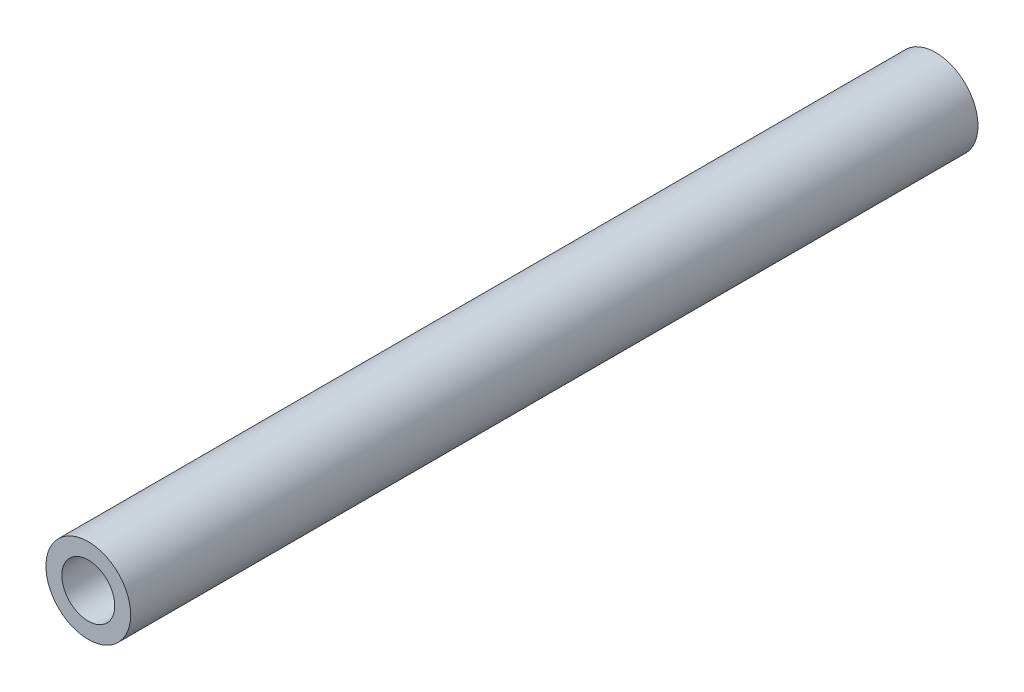
ISO-10303-21;
HEADER;
FILE_DESCRIPTION(('STEP AP214'),'2;1');
FILE_NAME('part.step','',(''),(''),'','','');
FILE_SCHEMA(('AUTOMOTIVE_DESIGN { 1 0 10303 214 1 1 1 1 }'));
ENDSEC;
DATA;
#1=APPLICATION_CONTEXT('core data for automotive mechanical design processes');
#2=APPLICATION_PROTOCOL_DEFINITION('international standard','automotive_design',2000,#1);
#3=PRODUCT_CONTEXT('',#1,'mechanical');
#4=PRODUCT('Part','Part','',(#3));
#5=PRODUCT_RELATED_PRODUCT_CATEGORY('part','',(#4));
#6=PRODUCT_DEFINITION_FORMATION('','',#4);
#7=PRODUCT_DEFINITION_CONTEXT('part definition',#1,'design');
#8=PRODUCT_DEFINITION('design','',#6,#7);
#9=PRODUCT_DEFINITION_SHAPE('','',#8);
#10=(LENGTH_UNIT() NAMED_UNIT(*) SI_UNIT(.MILLI.,.METRE.));
#11=(NAMED_UNIT(*) PLANE_ANGLE_UNIT() SI_UNIT($,.RADIAN.));
#12=(NAMED_UNIT(*) SI_UNIT($,.STERADIAN.) SOLID_ANGLE_UNIT());
#13=UNCERTAINTY_MEASURE_WITH_UNIT(LENGTH_MEASURE(1.E-05),#10,'distance_accuracy_value','');
#14=(GEOMETRIC_REPRESENTATION_CONTEXT(3) GLOBAL_UNCERTAINTY_ASSIGNED_CONTEXT((#13)) GLOBAL_UNIT_ASSIGNED_CONTEXT((#10,
#11,#12)) REPRESENTATION_CONTEXT('',''));
#15=CARTESIAN_POINT('',(0.,0.,0.));
#16=DIRECTION('',(0.,0.,1.));
#17=DIRECTION('',(1.,0.,0.));
#18=AXIS2_PLACEMENT_3D('',#15,#16,#17);
#19=CARTESIAN_POINT('',(0.,0.,32.));
#20=DIRECTION('',(0.,0.,1.));
#21=DIRECTION('',(1.,0.,0.));
#22=AXIS2_PLACEMENT_3D('',#19,#20,#21);
#23=PLANE('',#22);
#24=CARTESIAN_POINT('',(0.,0.,32.));
#25=DIRECTION('',(0.,0.,1.));
#26=DIRECTION('',(1.,0.,0.));
#27=AXIS2_PLACEMENT_3D('',#24,#25,#26);
#28=CIRCLE('',#27,1.6);
#29=CARTESIAN_POINT('',(1.6,0.,32.));
#30=VERTEX_POINT('',#29);
#31=EDGE_CURVE('E10',#30,#30,#28,.T.);
#32=ORIENTED_EDGE('',*,*,#31,.T.);
#33=EDGE_LOOP('',(#32));
#34=FACE_BOUND('',#33,.T.);
#35=CARTESIAN_POINT('',(0.,0.,32.));
#36=DIRECTION('',(0.,0.,1.));
#37=DIRECTION('',(1.,0.,0.));
#38=AXIS2_PLACEMENT_3D('',#35,#36,#37);
#39=CIRCLE('',#38,1.);
#40=CARTESIAN_POINT('',(1.,0.,32.));
#41=VERTEX_POINT('',#40);
#42=EDGE_CURVE('E50',#41,#41,#39,.T.);
#43=ORIENTED_EDGE('',*,*,#42,.F.);
#44=EDGE_LOOP('',(#43));
#45=FACE_BOUND('',#44,.T.);
#46=ADVANCED_FACE('F34',(#34,#45),#23,.T.);
#47=CARTESIAN_POINT('',(0.,0.,0.));
#48=DIRECTION('',(0.,0.,1.));
#49=DIRECTION('',(1.,0.,0.));
#50=AXIS2_PLACEMENT_3D('',#47,#48,#49);
#51=PLANE('',#50);
#52=CARTESIAN_POINT('',(0.,0.,0.));
#53=DIRECTION('',(0.,0.,1.));
#54=DIRECTION('',(1.,0.,0.));
#55=AXIS2_PLACEMENT_3D('',#52,#53,#54);
#56=CIRCLE('',#55,1.6);
#57=CARTESIAN_POINT('',(1.6,0.,0.));
#58=VERTEX_POINT('',#57);
#59=EDGE_CURVE('E38',#58,#58,#56,.T.);
#60=ORIENTED_EDGE('',*,*,#59,.F.);
#61=EDGE_LOOP('',(#60));
#62=FACE_BOUND('',#61,.T.);
#63=CARTESIAN_POINT('',(0.,0.,0.));
#64=DIRECTION('',(0.,0.,1.));
#65=DIRECTION('',(1.,0.,0.));
#66=AXIS2_PLACEMENT_3D('',#63,#64,#65);
#67=CIRCLE('',#66,1.);
#68=CARTESIAN_POINT('',(1.,0.,0.));
#69=VERTEX_POINT('',#68);
#70=EDGE_CURVE('E52',#69,#69,#67,.T.);
#71=ORIENTED_EDGE('',*,*,#70,.T.);
#72=EDGE_LOOP('',(#71));
#73=FACE_BOUND('',#72,.T.);
#74=ADVANCED_FACE('F64',(#62,#73),#51,.F.);
#75=CARTESIAN_POINT('',(0.,0.,32.));
#76=DIRECTION('',(0.,0.,-1.));
#77=DIRECTION('',(-1.,0.,0.));
#78=AXIS2_PLACEMENT_3D('',#75,#76,#77);
#79=CYLINDRICAL_SURFACE('',#78,1.6);
#80=ORIENTED_EDGE('',*,*,#31,.F.);
#81=EDGE_LOOP('',(#80));
#82=FACE_BOUND('',#81,.T.);
#83=ORIENTED_EDGE('',*,*,#59,.T.);
#84=EDGE_LOOP('',(#83));
#85=FACE_BOUND('',#84,.T.);
#86=ADVANCED_FACE('F36',(#82,#85),#79,.T.);
#87=CARTESIAN_POINT('',(0.,0.,32.));
#88=DIRECTION('',(0.,0.,-1.));
#89=DIRECTION('',(-1.,0.,0.));
#90=AXIS2_PLACEMENT_3D('',#87,#88,#89);
#91=CYLINDRICAL_SURFACE('',#90,1.);
#92=ORIENTED_EDGE('',*,*,#42,.T.);
#93=EDGE_LOOP('',(#92));
#94=FACE_BOUND('',#93,.T.);
#95=ORIENTED_EDGE('',*,*,#70,.F.);
#96=EDGE_LOOP('',(#95));
#97=FACE_BOUND('',#96,.T.);
#98=ADVANCED_FACE('F60',(#94,#97),#91,.F.);
#99=CLOSED_SHELL('',(#46,#74,#86,#98));
#100=MANIFOLD_SOLID_BREP('B2',#99);
#101=ADVANCED_BREP_SHAPE_REPRESENTATION('',(#18,#100),#14);
#102=SHAPE_DEFINITION_REPRESENTATION(#9,#101);
ENDSEC;
END-ISO-10303-21;
